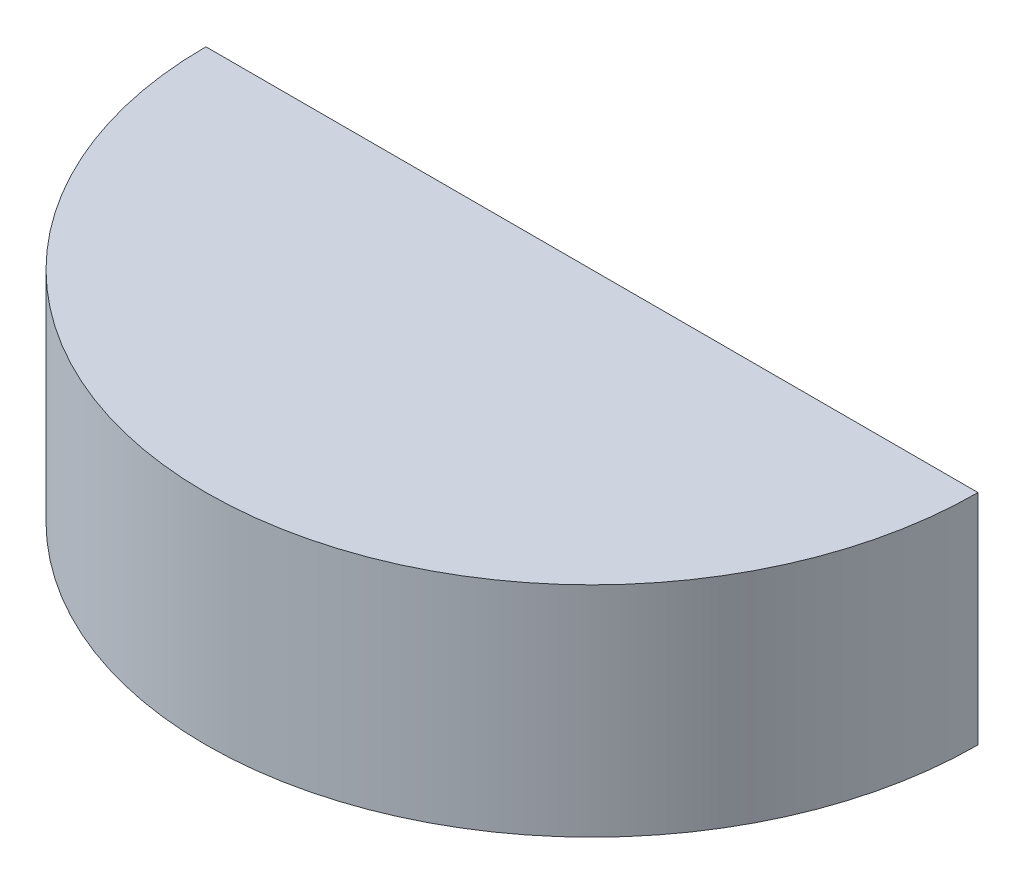
ISO-10303-21;
HEADER;
FILE_DESCRIPTION(('STEP AP214'),'2;1');
FILE_NAME('part.step','',(''),(''),'','','');
FILE_SCHEMA(('AUTOMOTIVE_DESIGN { 1 0 10303 214 1 1 1 1 }'));
ENDSEC;
DATA;
#1=APPLICATION_CONTEXT('core data for automotive mechanical design processes');
#2=APPLICATION_PROTOCOL_DEFINITION('international standard','automotive_design',2000,#1);
#3=PRODUCT_CONTEXT('',#1,'mechanical');
#4=PRODUCT('Part','Part','',(#3));
#5=PRODUCT_RELATED_PRODUCT_CATEGORY('part','',(#4));
#6=PRODUCT_DEFINITION_FORMATION('','',#4);
#7=PRODUCT_DEFINITION_CONTEXT('part definition',#1,'design');
#8=PRODUCT_DEFINITION('design','',#6,#7);
#9=PRODUCT_DEFINITION_SHAPE('','',#8);
#10=(LENGTH_UNIT() NAMED_UNIT(*) SI_UNIT(.MILLI.,.METRE.));
#11=(NAMED_UNIT(*) PLANE_ANGLE_UNIT() SI_UNIT($,.RADIAN.));
#12=(NAMED_UNIT(*) SI_UNIT($,.STERADIAN.) SOLID_ANGLE_UNIT());
#13=UNCERTAINTY_MEASURE_WITH_UNIT(LENGTH_MEASURE(1.E-05),#10,'distance_accuracy_value','');
#14=(GEOMETRIC_REPRESENTATION_CONTEXT(3) GLOBAL_UNCERTAINTY_ASSIGNED_CONTEXT((#13)) GLOBAL_UNIT_ASSIGNED_CONTEXT((#10,
#11,#12)) REPRESENTATION_CONTEXT('',''));
#15=CARTESIAN_POINT('',(0.,0.,0.));
#16=DIRECTION('',(0.,0.,1.));
#17=DIRECTION('',(1.,0.,0.));
#18=AXIS2_PLACEMENT_3D('',#15,#16,#17);
#19=CARTESIAN_POINT('',(59.1914661779905,-43.9359974390858,-29.7525439278961));
#20=DIRECTION('',(0.,0.,-1.));
#21=DIRECTION('',(-1.,0.,0.));
#22=AXIS2_PLACEMENT_3D('',#19,#20,#21);
#23=PLANE('',#22);
#24=DIRECTION('',(0.,-1.,0.));
#25=VECTOR('',#24,1.);
#26=CARTESIAN_POINT('',(-52.5685338220095,19.4497025609142,-29.7525439278961));
#27=LINE('',#26,#25);
#28=CARTESIAN_POINT('',(-52.5685338220095,9.92470256091423,-29.7525439278961));
#29=VERTEX_POINT('',#28);
#30=CARTESIAN_POINT('',(-52.5685338220095,-21.7109974390858,-29.7525439278961));
#31=VERTEX_POINT('',#30);
#32=EDGE_CURVE('E11',#29,#31,#27,.T.);
#33=ORIENTED_EDGE('',*,*,#32,.F.);
#34=DIRECTION('',(1.,0.,0.));
#35=VECTOR('',#34,1.);
#36=CARTESIAN_POINT('',(59.1914661779905,9.92470256091423,-29.7525439278961));
#37=LINE('',#36,#35);
#38=CARTESIAN_POINT('',(59.1914661779905,9.92470256091423,-29.7525439278961));
#39=VERTEX_POINT('',#38);
#40=EDGE_CURVE('E96',#29,#39,#37,.T.);
#41=ORIENTED_EDGE('',*,*,#40,.T.);
#42=DIRECTION('',(0.,1.,0.));
#43=VECTOR('',#42,1.);
#44=CARTESIAN_POINT('',(59.1914661779905,19.4497025609142,-29.7525439278961));
#45=LINE('',#44,#43);
#46=CARTESIAN_POINT('',(59.1914661779905,-21.7109974390858,-29.7525439278961));
#47=VERTEX_POINT('',#46);
#48=EDGE_CURVE('E43',#47,#39,#45,.T.);
#49=ORIENTED_EDGE('',*,*,#48,.F.);
#50=DIRECTION('',(1.,0.,0.));
#51=VECTOR('',#50,1.);
#52=CARTESIAN_POINT('',(73.1614661779904,-21.7109974390858,-29.7525439278961));
#53=LINE('',#52,#51);
#54=CARTESIAN_POINT('',(56.6514661779904,-21.7109974390858,-29.7525439278961));
#55=VERTEX_POINT('',#54);
#56=EDGE_CURVE('E90',#55,#47,#53,.T.);
#57=ORIENTED_EDGE('',*,*,#56,.F.);
#58=DIRECTION('',(0.,-1.,0.));
#59=VECTOR('',#58,1.);
#60=CARTESIAN_POINT('',(56.6514661779904,-21.7109974390858,-29.7525439278961));
#61=LINE('',#60,#59);
#62=CARTESIAN_POINT('',(56.6514661779904,-22.0792974390858,-29.7525439278961));
#63=VERTEX_POINT('',#62);
#64=EDGE_CURVE('E79',#55,#63,#61,.T.);
#65=ORIENTED_EDGE('',*,*,#64,.T.);
#66=DIRECTION('',(1.,0.,0.));
#67=VECTOR('',#66,1.);
#68=CARTESIAN_POINT('',(59.1914661779905,-22.0792974390858,-29.7525439278961));
#69=LINE('',#68,#67);
#70=CARTESIAN_POINT('',(-50.0285338220095,-22.0792974390858,-29.7525439278961));
#71=VERTEX_POINT('',#70);
#72=EDGE_CURVE('E84',#71,#63,#69,.T.);
#73=ORIENTED_EDGE('',*,*,#72,.F.);
#74=DIRECTION('',(0.,-1.,0.));
#75=VECTOR('',#74,1.);
#76=CARTESIAN_POINT('',(-50.0285338220095,-21.7109974390858,-29.7525439278961));
#77=LINE('',#76,#75);
#78=CARTESIAN_POINT('',(-50.0285338220095,-21.7109974390858,-29.7525439278961));
#79=VERTEX_POINT('',#78);
#80=EDGE_CURVE('E81',#79,#71,#77,.T.);
#81=ORIENTED_EDGE('',*,*,#80,.F.);
#82=EDGE_CURVE('E105',#31,#79,#53,.T.);
#83=ORIENTED_EDGE('',*,*,#82,.F.);
#84=EDGE_LOOP('',(#33,#41,#49,#57,#65,#73,#81,#83));
#85=FACE_BOUND('',#84,.T.);
#86=ADVANCED_FACE('F34',(#85),#23,.T.);
#87=CARTESIAN_POINT('',(3.3114661779905,9.92470256091422,-29.7525439278961));
#88=DIRECTION('',(0.,-1.,0.));
#89=DIRECTION('',(0.,0.,-1.));
#90=AXIS2_PLACEMENT_3D('',#87,#88,#89);
#91=CYLINDRICAL_SURFACE('',#90,55.88);
#92=ORIENTED_EDGE('',*,*,#48,.T.);
#93=CARTESIAN_POINT('',(3.3114661779905,9.92470256091422,-29.7525439278961));
#94=DIRECTION('',(0.,-1.,0.));
#95=DIRECTION('',(0.,0.,-1.));
#96=AXIS2_PLACEMENT_3D('',#93,#94,#95);
#97=CIRCLE('',#96,55.88);
#98=EDGE_CURVE('E99',#39,#29,#97,.T.);
#99=ORIENTED_EDGE('',*,*,#98,.T.);
#100=ORIENTED_EDGE('',*,*,#32,.T.);
#101=CARTESIAN_POINT('',(3.31146617799043,-21.7109974390858,-29.7525439278961));
#102=DIRECTION('',(0.,1.,0.));
#103=DIRECTION('',(0.,0.,-1.));
#104=AXIS2_PLACEMENT_3D('',#101,#102,#103);
#105=CIRCLE('',#104,55.88);
#106=EDGE_CURVE('E111',#31,#47,#105,.T.);
#107=ORIENTED_EDGE('',*,*,#106,.T.);
#108=EDGE_LOOP('',(#92,#99,#100,#107));
#109=FACE_BOUND('',#108,.T.);
#110=ADVANCED_FACE('F36',(#109),#91,.T.);
#111=CARTESIAN_POINT('',(-58.3130040874097,9.9247025609142,26.1374810721039));
#112=DIRECTION('',(0.,1.,0.));
#113=DIRECTION('',(0.,0.,1.));
#114=AXIS2_PLACEMENT_3D('',#111,#112,#113);
#115=PLANE('',#114);
#116=ORIENTED_EDGE('',*,*,#40,.F.);
#117=ORIENTED_EDGE('',*,*,#98,.F.);
#118=EDGE_LOOP('',(#116,#117));
#119=FACE_BOUND('',#118,.T.);
#120=ADVANCED_FACE('F127',(#119),#115,.T.);
#121=CARTESIAN_POINT('',(-58.31300408741,-22.0792974390858,26.1374810721039));
#122=DIRECTION('',(0.,1.,0.));
#123=DIRECTION('',(0.,0.,1.));
#124=AXIS2_PLACEMENT_3D('',#121,#122,#123);
#125=PLANE('',#124);
#126=ORIENTED_EDGE('',*,*,#72,.T.);
#127=CARTESIAN_POINT('',(3.31146617799043,-22.0792974390858,-29.7525439278961));
#128=DIRECTION('',(0.,1.,0.));
#129=DIRECTION('',(0.,0.,1.));
#130=AXIS2_PLACEMENT_3D('',#127,#128,#129);
#131=CIRCLE('',#130,53.34);
#132=EDGE_CURVE('E74',#63,#71,#131,.F.);
#133=ORIENTED_EDGE('',*,*,#132,.T.);
#134=EDGE_LOOP('',(#126,#133));
#135=FACE_BOUND('',#134,.T.);
#136=ADVANCED_FACE('F86',(#135),#125,.F.);
#137=CARTESIAN_POINT('',(-70.9494457008639,-21.7109974390858,-29.7625439278961));
#138=DIRECTION('',(0.,-1.,0.));
#139=DIRECTION('',(0.,0.,1.));
#140=AXIS2_PLACEMENT_3D('',#137,#138,#139);
#141=PLANE('',#140);
#142=ORIENTED_EDGE('',*,*,#82,.T.);
#143=CARTESIAN_POINT('',(3.31146617799043,-21.7109974390858,-29.7525439278961));
#144=DIRECTION('',(0.,-1.,0.));
#145=DIRECTION('',(0.,0.,1.));
#146=AXIS2_PLACEMENT_3D('',#143,#144,#145);
#147=CIRCLE('',#146,53.34);
#148=EDGE_CURVE('E92',#55,#79,#147,.T.);
#149=ORIENTED_EDGE('',*,*,#148,.F.);
#150=ORIENTED_EDGE('',*,*,#56,.T.);
#151=ORIENTED_EDGE('',*,*,#106,.F.);
#152=EDGE_LOOP('',(#142,#149,#150,#151));
#153=FACE_BOUND('',#152,.T.);
#154=ADVANCED_FACE('F119',(#153),#141,.T.);
#155=CARTESIAN_POINT('',(3.31146617799043,-21.7109974390858,-29.7525439278961));
#156=DIRECTION('',(0.,-1.,0.));
#157=DIRECTION('',(0.,0.,-1.));
#158=AXIS2_PLACEMENT_3D('',#155,#156,#157);
#159=CYLINDRICAL_SURFACE('',#158,53.34);
#160=ORIENTED_EDGE('',*,*,#132,.F.);
#161=ORIENTED_EDGE('',*,*,#64,.F.);
#162=ORIENTED_EDGE('',*,*,#148,.T.);
#163=ORIENTED_EDGE('',*,*,#80,.T.);
#164=EDGE_LOOP('',(#160,#161,#162,#163));
#165=FACE_BOUND('',#164,.T.);
#166=ADVANCED_FACE('F76',(#165),#159,.T.);
#167=CLOSED_SHELL('',(#86,#110,#120,#136,#154,#166));
#168=MANIFOLD_SOLID_BREP('B2',#167);
#169=ADVANCED_BREP_SHAPE_REPRESENTATION('',(#18,#168),#14);
#170=SHAPE_DEFINITION_REPRESENTATION(#9,#169);
ENDSEC;
END-ISO-10303-21;
